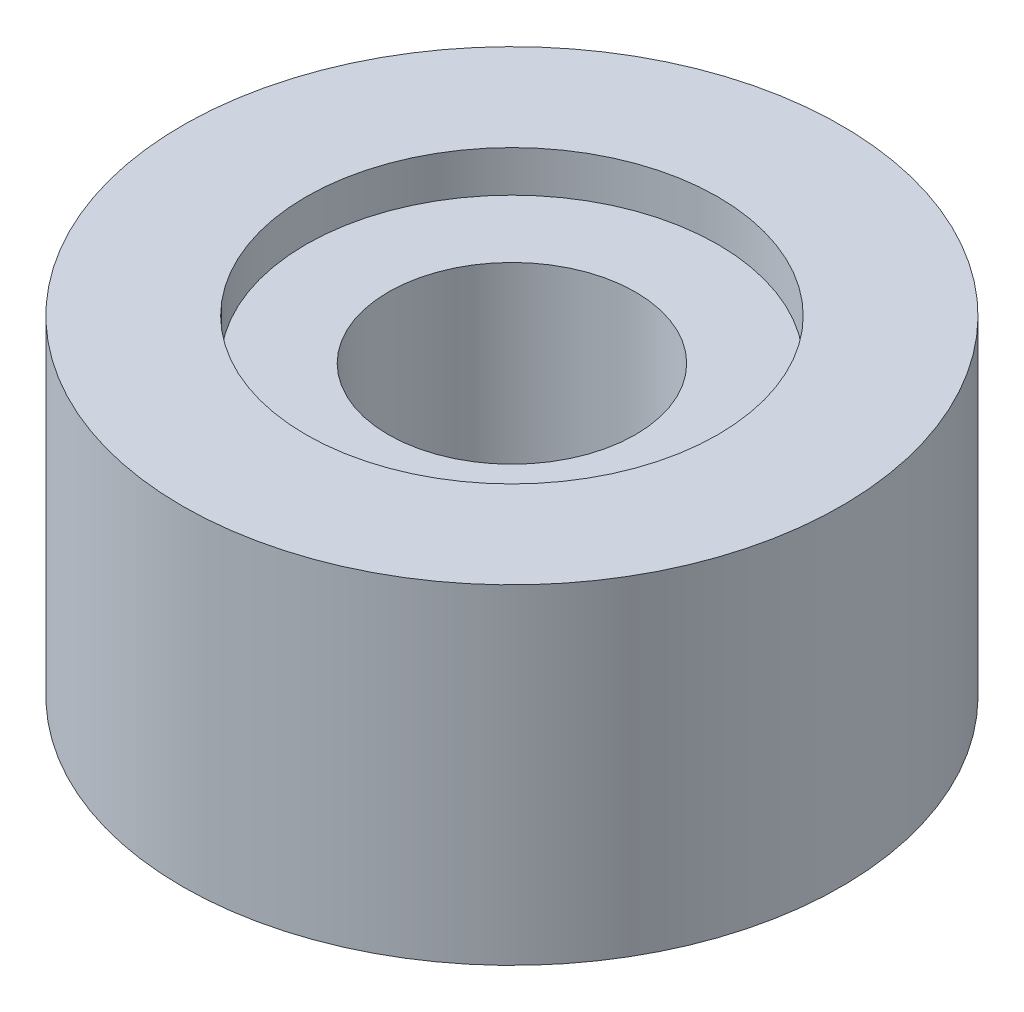
ISO-10303-21;
HEADER;
FILE_DESCRIPTION(('STEP AP214'),'2;1');
FILE_NAME('part.step','',(''),(''),'','','');
FILE_SCHEMA(('AUTOMOTIVE_DESIGN { 1 0 10303 214 1 1 1 1 }'));
ENDSEC;
DATA;
#1=APPLICATION_CONTEXT('core data for automotive mechanical design processes');
#2=APPLICATION_PROTOCOL_DEFINITION('international standard','automotive_design',2000,#1);
#3=PRODUCT_CONTEXT('',#1,'mechanical');
#4=PRODUCT('Part','Part','',(#3));
#5=PRODUCT_RELATED_PRODUCT_CATEGORY('part','',(#4));
#6=PRODUCT_DEFINITION_FORMATION('','',#4);
#7=PRODUCT_DEFINITION_CONTEXT('part definition',#1,'design');
#8=PRODUCT_DEFINITION('design','',#6,#7);
#9=PRODUCT_DEFINITION_SHAPE('','',#8);
#10=(LENGTH_UNIT() NAMED_UNIT(*) SI_UNIT(.MILLI.,.METRE.));
#11=(NAMED_UNIT(*) PLANE_ANGLE_UNIT() SI_UNIT($,.RADIAN.));
#12=(NAMED_UNIT(*) SI_UNIT($,.STERADIAN.) SOLID_ANGLE_UNIT());
#13=UNCERTAINTY_MEASURE_WITH_UNIT(LENGTH_MEASURE(1.E-05),#10,'distance_accuracy_value','');
#14=(GEOMETRIC_REPRESENTATION_CONTEXT(3) GLOBAL_UNCERTAINTY_ASSIGNED_CONTEXT((#13)) GLOBAL_UNIT_ASSIGNED_CONTEXT((#10,
#11,#12)) REPRESENTATION_CONTEXT('',''));
#15=CARTESIAN_POINT('',(0.,0.,0.));
#16=DIRECTION('',(0.,0.,1.));
#17=DIRECTION('',(1.,0.,0.));
#18=AXIS2_PLACEMENT_3D('',#15,#16,#17);
#19=CARTESIAN_POINT('',(0.,6.,0.));
#20=DIRECTION('',(0.,-1.,0.));
#21=DIRECTION('',(0.,0.,-1.));
#22=AXIS2_PLACEMENT_3D('',#19,#20,#21);
#23=CYLINDRICAL_SURFACE('',#22,6.);
#24=CARTESIAN_POINT('',(0.,6.,0.));
#25=DIRECTION('',(0.,1.,0.));
#26=DIRECTION('',(0.,0.,1.));
#27=AXIS2_PLACEMENT_3D('',#24,#25,#26);
#28=CIRCLE('',#27,6.);
#29=CARTESIAN_POINT('',(0.,6.,6.));
#30=VERTEX_POINT('',#29);
#31=EDGE_CURVE('E10',#30,#30,#28,.T.);
#32=ORIENTED_EDGE('',*,*,#31,.F.);
#33=EDGE_LOOP('',(#32));
#34=FACE_BOUND('',#33,.T.);
#35=CARTESIAN_POINT('',(0.,0.,0.));
#36=DIRECTION('',(0.,1.,0.));
#37=DIRECTION('',(0.,0.,1.));
#38=AXIS2_PLACEMENT_3D('',#35,#36,#37);
#39=CIRCLE('',#38,6.);
#40=CARTESIAN_POINT('',(0.,0.,6.));
#41=VERTEX_POINT('',#40);
#42=EDGE_CURVE('E36',#41,#41,#39,.T.);
#43=ORIENTED_EDGE('',*,*,#42,.T.);
#44=EDGE_LOOP('',(#43));
#45=FACE_BOUND('',#44,.T.);
#46=ADVANCED_FACE('F29',(#34,#45),#23,.T.);
#47=CARTESIAN_POINT('',(0.,6.,0.));
#48=DIRECTION('',(0.,1.,0.));
#49=DIRECTION('',(0.,0.,1.));
#50=AXIS2_PLACEMENT_3D('',#47,#48,#49);
#51=PLANE('',#50);
#52=CARTESIAN_POINT('',(0.,6.,0.));
#53=DIRECTION('',(0.,1.,0.));
#54=DIRECTION('',(0.,0.,1.));
#55=AXIS2_PLACEMENT_3D('',#52,#53,#54);
#56=CIRCLE('',#55,3.75);
#57=CARTESIAN_POINT('',(0.,6.,3.75));
#58=VERTEX_POINT('',#57);
#59=EDGE_CURVE('E45',#58,#58,#56,.T.);
#60=ORIENTED_EDGE('',*,*,#59,.F.);
#61=EDGE_LOOP('',(#60));
#62=FACE_BOUND('',#61,.T.);
#63=ORIENTED_EDGE('',*,*,#31,.T.);
#64=EDGE_LOOP('',(#63));
#65=FACE_BOUND('',#64,.T.);
#66=ADVANCED_FACE('F71',(#62,#65),#51,.T.);
#67=CARTESIAN_POINT('',(0.,0.,0.));
#68=DIRECTION('',(0.,1.,0.));
#69=DIRECTION('',(0.,0.,1.));
#70=AXIS2_PLACEMENT_3D('',#67,#68,#69);
#71=PLANE('',#70);
#72=ORIENTED_EDGE('',*,*,#42,.F.);
#73=EDGE_LOOP('',(#72));
#74=FACE_BOUND('',#73,.T.);
#75=ADVANCED_FACE('F76',(#74),#71,.F.);
#76=CARTESIAN_POINT('',(0.,5.25,0.));
#77=DIRECTION('',(0.,1.,0.));
#78=DIRECTION('',(0.,0.,1.));
#79=AXIS2_PLACEMENT_3D('',#76,#77,#78);
#80=PLANE('',#79);
#81=CARTESIAN_POINT('',(0.,5.25,0.));
#82=DIRECTION('',(0.,1.,0.));
#83=DIRECTION('',(0.,0.,1.));
#84=AXIS2_PLACEMENT_3D('',#81,#82,#83);
#85=CIRCLE('',#84,3.75);
#86=CARTESIAN_POINT('',(0.,5.25,3.75));
#87=VERTEX_POINT('',#86);
#88=EDGE_CURVE('E48',#87,#87,#85,.T.);
#89=ORIENTED_EDGE('',*,*,#88,.T.);
#90=EDGE_LOOP('',(#89));
#91=FACE_BOUND('',#90,.T.);
#92=CARTESIAN_POINT('',(0.,5.25,0.));
#93=DIRECTION('',(0.,1.,0.));
#94=DIRECTION('',(0.,0.,1.));
#95=AXIS2_PLACEMENT_3D('',#92,#93,#94);
#96=CIRCLE('',#95,2.25);
#97=CARTESIAN_POINT('',(0.,5.25,2.25));
#98=VERTEX_POINT('',#97);
#99=EDGE_CURVE('E32',#98,#98,#96,.F.);
#100=ORIENTED_EDGE('',*,*,#99,.T.);
#101=EDGE_LOOP('',(#100));
#102=FACE_BOUND('',#101,.T.);
#103=ADVANCED_FACE('F55',(#91,#102),#80,.T.);
#104=CARTESIAN_POINT('',(0.,5.25,0.));
#105=DIRECTION('',(0.,1.,0.));
#106=DIRECTION('',(0.,0.,1.));
#107=AXIS2_PLACEMENT_3D('',#104,#105,#106);
#108=CYLINDRICAL_SURFACE('',#107,3.75);
#109=ORIENTED_EDGE('',*,*,#88,.F.);
#110=EDGE_LOOP('',(#109));
#111=FACE_BOUND('',#110,.T.);
#112=ORIENTED_EDGE('',*,*,#59,.T.);
#113=EDGE_LOOP('',(#112));
#114=FACE_BOUND('',#113,.T.);
#115=ADVANCED_FACE('F65',(#111,#114),#108,.F.);
#116=CARTESIAN_POINT('',(0.,1.,0.));
#117=DIRECTION('',(0.,1.,0.));
#118=DIRECTION('',(0.,0.,1.));
#119=AXIS2_PLACEMENT_3D('',#116,#117,#118);
#120=PLANE('',#119);
#121=CARTESIAN_POINT('',(0.,1.,0.));
#122=DIRECTION('',(0.,1.,0.));
#123=DIRECTION('',(0.,0.,1.));
#124=AXIS2_PLACEMENT_3D('',#121,#122,#123);
#125=CIRCLE('',#124,2.25);
#126=CARTESIAN_POINT('',(0.,1.,2.25));
#127=VERTEX_POINT('',#126);
#128=EDGE_CURVE('E41',#127,#127,#125,.T.);
#129=ORIENTED_EDGE('',*,*,#128,.T.);
#130=EDGE_LOOP('',(#129));
#131=FACE_BOUND('',#130,.T.);
#132=ADVANCED_FACE('F59',(#131),#120,.T.);
#133=CARTESIAN_POINT('',(0.,1.,0.));
#134=DIRECTION('',(0.,1.,0.));
#135=DIRECTION('',(0.,0.,1.));
#136=AXIS2_PLACEMENT_3D('',#133,#134,#135);
#137=CYLINDRICAL_SURFACE('',#136,2.25);
#138=ORIENTED_EDGE('',*,*,#128,.F.);
#139=EDGE_LOOP('',(#138));
#140=FACE_BOUND('',#139,.T.);
#141=ORIENTED_EDGE('',*,*,#99,.F.);
#142=EDGE_LOOP('',(#141));
#143=FACE_BOUND('',#142,.T.);
#144=ADVANCED_FACE('F57',(#140,#143),#137,.F.);
#145=CLOSED_SHELL('',(#46,#66,#75,#103,#115,#132,#144));
#146=MANIFOLD_SOLID_BREP('B2',#145);
#147=ADVANCED_BREP_SHAPE_REPRESENTATION('',(#18,#146),#14);
#148=SHAPE_DEFINITION_REPRESENTATION(#9,#147);
ENDSEC;
END-ISO-10303-21;
